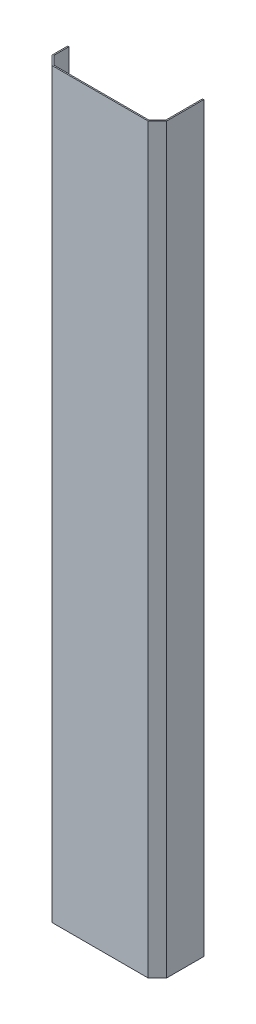
ISO-10303-21;
HEADER;
FILE_DESCRIPTION(('STEP AP214'),'2;1');
FILE_NAME('part.step','',(''),(''),'','','');
FILE_SCHEMA(('AUTOMOTIVE_DESIGN { 1 0 10303 214 1 1 1 1 }'));
ENDSEC;
DATA;
#1=APPLICATION_CONTEXT('core data for automotive mechanical design processes');
#2=APPLICATION_PROTOCOL_DEFINITION('international standard','automotive_design',2000,#1);
#3=PRODUCT_CONTEXT('',#1,'mechanical');
#4=PRODUCT('Part','Part','',(#3));
#5=PRODUCT_RELATED_PRODUCT_CATEGORY('part','',(#4));
#6=PRODUCT_DEFINITION_FORMATION('','',#4);
#7=PRODUCT_DEFINITION_CONTEXT('part definition',#1,'design');
#8=PRODUCT_DEFINITION('design','',#6,#7);
#9=PRODUCT_DEFINITION_SHAPE('','',#8);
#10=(LENGTH_UNIT() NAMED_UNIT(*) SI_UNIT(.MILLI.,.METRE.));
#11=(NAMED_UNIT(*) PLANE_ANGLE_UNIT() SI_UNIT($,.RADIAN.));
#12=(NAMED_UNIT(*) SI_UNIT($,.STERADIAN.) SOLID_ANGLE_UNIT());
#13=UNCERTAINTY_MEASURE_WITH_UNIT(LENGTH_MEASURE(1.E-05),#10,'distance_accuracy_value','');
#14=(GEOMETRIC_REPRESENTATION_CONTEXT(3) GLOBAL_UNCERTAINTY_ASSIGNED_CONTEXT((#13)) GLOBAL_UNIT_ASSIGNED_CONTEXT((#10,
#11,#12)) REPRESENTATION_CONTEXT('',''));
#15=CARTESIAN_POINT('',(0.,0.,0.));
#16=DIRECTION('',(0.,0.,1.));
#17=DIRECTION('',(1.,0.,0.));
#18=AXIS2_PLACEMENT_3D('',#15,#16,#17);
#19=CARTESIAN_POINT('',(0.,1200.,-40.));
#20=DIRECTION('',(0.,0.,-1.));
#21=DIRECTION('',(-1.,0.,0.));
#22=AXIS2_PLACEMENT_3D('',#19,#20,#21);
#23=PLANE('',#22);
#24=DIRECTION('',(-1.,0.,0.));
#25=VECTOR('',#24,1.);
#26=CARTESIAN_POINT('',(185.001,220.,-40.));
#27=LINE('',#26,#25);
#28=CARTESIAN_POINT('',(2.,220.,-40.));
#29=VERTEX_POINT('',#28);
#30=CARTESIAN_POINT('',(0.,220.,-40.));
#31=VERTEX_POINT('',#30);
#32=EDGE_CURVE('E173',#29,#31,#27,.T.);
#33=ORIENTED_EDGE('',*,*,#32,.T.);
#34=DIRECTION('',(0.,-1.,0.));
#35=VECTOR('',#34,1.);
#36=CARTESIAN_POINT('',(0.,1200.,-40.));
#37=LINE('',#36,#35);
#38=CARTESIAN_POINT('',(0.,1115.,-40.));
#39=VERTEX_POINT('',#38);
#40=EDGE_CURVE('E277',#39,#31,#37,.T.);
#41=ORIENTED_EDGE('',*,*,#40,.F.);
#42=DIRECTION('',(-1.,0.,0.));
#43=VECTOR('',#42,1.);
#44=CARTESIAN_POINT('',(185.001,1115.,-40.));
#45=LINE('',#44,#43);
#46=CARTESIAN_POINT('',(2.,1115.,-40.));
#47=VERTEX_POINT('',#46);
#48=EDGE_CURVE('E58',#47,#39,#45,.T.);
#49=ORIENTED_EDGE('',*,*,#48,.F.);
#50=DIRECTION('',(0.,-1.,0.));
#51=VECTOR('',#50,1.);
#52=CARTESIAN_POINT('',(2.,1200.,-40.));
#53=LINE('',#52,#51);
#54=EDGE_CURVE('E190',#47,#29,#53,.T.);
#55=ORIENTED_EDGE('',*,*,#54,.T.);
#56=EDGE_LOOP('',(#33,#41,#49,#55));
#57=FACE_BOUND('',#56,.T.);
#58=ADVANCED_FACE('F35',(#57),#23,.T.);
#59=DIRECTION('',(-1.,0.,0.));
#60=VECTOR('',#59,1.);
#61=CARTESIAN_POINT('',(185.001,1155.,-40.));
#62=LINE('',#61,#60);
#63=CARTESIAN_POINT('',(2.,1155.,-40.));
#64=VERTEX_POINT('',#63);
#65=CARTESIAN_POINT('',(0.,1155.,-40.));
#66=VERTEX_POINT('',#65);
#67=EDGE_CURVE('E295',#64,#66,#62,.T.);
#68=ORIENTED_EDGE('',*,*,#67,.T.);
#69=CARTESIAN_POINT('',(0.,1200.,-40.));
#70=VERTEX_POINT('',#69);
#71=EDGE_CURVE('E200',#70,#66,#37,.T.);
#72=ORIENTED_EDGE('',*,*,#71,.F.);
#73=DIRECTION('',(1.,0.,0.));
#74=VECTOR('',#73,1.);
#75=CARTESIAN_POINT('',(0.,1200.,-40.));
#76=LINE('',#75,#74);
#77=CARTESIAN_POINT('',(2.,1200.,-40.));
#78=VERTEX_POINT('',#77);
#79=EDGE_CURVE('E294',#70,#78,#76,.T.);
#80=ORIENTED_EDGE('',*,*,#79,.T.);
#81=EDGE_CURVE('E195',#78,#64,#53,.T.);
#82=ORIENTED_EDGE('',*,*,#81,.T.);
#83=EDGE_LOOP('',(#68,#72,#80,#82));
#84=FACE_BOUND('',#83,.T.);
#85=ADVANCED_FACE('F293',(#84),#23,.T.);
#86=CARTESIAN_POINT('',(83.5857864376268,1200.,83.5857864376269));
#87=DIRECTION('',(-0.707106781186547,0.,-0.707106781186548));
#88=DIRECTION('',(-0.707106781186548,0.,0.707106781186547));
#89=AXIS2_PLACEMENT_3D('',#86,#87,#88);
#90=PLANE('',#89);
#91=DIRECTION('',(0.707106781186548,0.,-0.707106781186547));
#92=VECTOR('',#91,1.);
#93=CARTESIAN_POINT('',(83.5857864376268,0.,83.5857864376269));
#94=LINE('',#93,#92);
#95=CARTESIAN_POINT('',(169.171572875254,0.,-2.));
#96=VERTEX_POINT('',#95);
#97=CARTESIAN_POINT('',(183.,0.,-15.8284271247462));
#98=VERTEX_POINT('',#97);
#99=EDGE_CURVE('E228',#96,#98,#94,.T.);
#100=ORIENTED_EDGE('',*,*,#99,.F.);
#101=DIRECTION('',(0.,-1.,0.));
#102=VECTOR('',#101,1.);
#103=CARTESIAN_POINT('',(169.171572875254,1200.,-2.));
#104=LINE('',#103,#102);
#105=CARTESIAN_POINT('',(169.171572875254,1200.,-2.));
#106=VERTEX_POINT('',#105);
#107=EDGE_CURVE('E11',#106,#96,#104,.T.);
#108=ORIENTED_EDGE('',*,*,#107,.F.);
#109=DIRECTION('',(0.707106781186548,0.,-0.707106781186547));
#110=VECTOR('',#109,1.);
#111=CARTESIAN_POINT('',(83.5857864376268,1200.,83.5857864376269));
#112=LINE('',#111,#110);
#113=CARTESIAN_POINT('',(183.,1200.,-15.8284271247462));
#114=VERTEX_POINT('',#113);
#115=EDGE_CURVE('E255',#106,#114,#112,.T.);
#116=ORIENTED_EDGE('',*,*,#115,.T.);
#117=DIRECTION('',(0.,-1.,0.));
#118=VECTOR('',#117,1.);
#119=CARTESIAN_POINT('',(183.,1200.,-15.8284271247462));
#120=LINE('',#119,#118);
#121=EDGE_CURVE('E256',#114,#98,#120,.T.);
#122=ORIENTED_EDGE('',*,*,#121,.T.);
#123=EDGE_LOOP('',(#100,#108,#116,#122));
#124=FACE_BOUND('',#123,.T.);
#125=ADVANCED_FACE('F37',(#124),#90,.T.);
#126=CARTESIAN_POINT('',(0.,1200.,-2.));
#127=DIRECTION('',(0.,0.,-1.));
#128=DIRECTION('',(-1.,0.,0.));
#129=AXIS2_PLACEMENT_3D('',#126,#127,#128);
#130=PLANE('',#129);
#131=DIRECTION('',(1.,0.,0.));
#132=VECTOR('',#131,1.);
#133=CARTESIAN_POINT('',(0.,0.,-2.));
#134=LINE('',#133,#132);
#135=CARTESIAN_POINT('',(15.8284271247462,0.,-2.));
#136=VERTEX_POINT('',#135);
#137=EDGE_CURVE('E221',#136,#96,#134,.T.);
#138=ORIENTED_EDGE('',*,*,#137,.F.);
#139=DIRECTION('',(0.,-1.,0.));
#140=VECTOR('',#139,1.);
#141=CARTESIAN_POINT('',(15.8284271247462,1200.,-2.));
#142=LINE('',#141,#140);
#143=CARTESIAN_POINT('',(15.8284271247462,1200.,-2.));
#144=VERTEX_POINT('',#143);
#145=EDGE_CURVE('E43',#144,#136,#142,.T.);
#146=ORIENTED_EDGE('',*,*,#145,.F.);
#147=DIRECTION('',(1.,0.,0.));
#148=VECTOR('',#147,1.);
#149=CARTESIAN_POINT('',(0.,1200.,-2.));
#150=LINE('',#149,#148);
#151=EDGE_CURVE('E332',#144,#106,#150,.T.);
#152=ORIENTED_EDGE('',*,*,#151,.T.);
#153=ORIENTED_EDGE('',*,*,#107,.T.);
#154=EDGE_LOOP('',(#138,#146,#152,#153));
#155=FACE_BOUND('',#154,.T.);
#156=ADVANCED_FACE('F226',(#155),#130,.T.);
#157=CARTESIAN_POINT('',(8.9142135623731,1200.,-8.9142135623731));
#158=DIRECTION('',(-0.707106781186548,0.,0.707106781186548));
#159=DIRECTION('',(0.707106781186548,0.,0.707106781186548));
#160=AXIS2_PLACEMENT_3D('',#157,#158,#159);
#161=PLANE('',#160);
#162=DIRECTION('',(-0.707106781186548,0.,-0.707106781186548));
#163=VECTOR('',#162,1.);
#164=CARTESIAN_POINT('',(8.9142135623731,0.,-8.9142135623731));
#165=LINE('',#164,#163);
#166=CARTESIAN_POINT('',(2.,0.,-15.8284271247462));
#167=VERTEX_POINT('',#166);
#168=EDGE_CURVE('E210',#136,#167,#165,.T.);
#169=ORIENTED_EDGE('',*,*,#168,.T.);
#170=DIRECTION('',(0.,-1.,0.));
#171=VECTOR('',#170,1.);
#172=CARTESIAN_POINT('',(2.,1200.,-15.8284271247462));
#173=LINE('',#172,#171);
#174=CARTESIAN_POINT('',(2.,1200.,-15.8284271247462));
#175=VERTEX_POINT('',#174);
#176=EDGE_CURVE('E199',#175,#167,#173,.T.);
#177=ORIENTED_EDGE('',*,*,#176,.F.);
#178=DIRECTION('',(-0.707106781186548,0.,-0.707106781186548));
#179=VECTOR('',#178,1.);
#180=CARTESIAN_POINT('',(8.9142135623731,1200.,-8.9142135623731));
#181=LINE('',#180,#179);
#182=EDGE_CURVE('E211',#144,#175,#181,.T.);
#183=ORIENTED_EDGE('',*,*,#182,.F.);
#184=ORIENTED_EDGE('',*,*,#145,.T.);
#185=EDGE_LOOP('',(#169,#177,#183,#184));
#186=FACE_BOUND('',#185,.T.);
#187=ADVANCED_FACE('F208',(#186),#161,.F.);
#188=CARTESIAN_POINT('',(2.,1200.,0.));
#189=DIRECTION('',(-1.,0.,0.));
#190=DIRECTION('',(0.,0.,1.));
#191=AXIS2_PLACEMENT_3D('',#188,#189,#190);
#192=PLANE('',#191);
#193=DIRECTION('',(0.,-1.,0.));
#194=VECTOR('',#193,1.);
#195=CARTESIAN_POINT('',(2.,220.,-20.));
#196=LINE('',#195,#194);
#197=CARTESIAN_POINT('',(2.,220.,-20.));
#198=VERTEX_POINT('',#197);
#199=CARTESIAN_POINT('',(2.,180.,-20.));
#200=VERTEX_POINT('',#199);
#201=EDGE_CURVE('E193',#198,#200,#196,.T.);
#202=ORIENTED_EDGE('',*,*,#201,.F.);
#203=DIRECTION('',(0.,0.,1.));
#204=VECTOR('',#203,1.);
#205=CARTESIAN_POINT('',(2.,220.,-40.));
#206=LINE('',#205,#204);
#207=EDGE_CURVE('E176',#29,#198,#206,.T.);
#208=ORIENTED_EDGE('',*,*,#207,.F.);
#209=ORIENTED_EDGE('',*,*,#54,.F.);
#210=DIRECTION('',(0.,0.,-1.));
#211=VECTOR('',#210,1.);
#212=CARTESIAN_POINT('',(2.,1115.,-40.));
#213=LINE('',#212,#211);
#214=CARTESIAN_POINT('',(2.,1115.,-20.));
#215=VERTEX_POINT('',#214);
#216=EDGE_CURVE('E345',#215,#47,#213,.T.);
#217=ORIENTED_EDGE('',*,*,#216,.F.);
#218=DIRECTION('',(0.,-1.,0.));
#219=VECTOR('',#218,1.);
#220=CARTESIAN_POINT('',(2.,1155.,-20.));
#221=LINE('',#220,#219);
#222=CARTESIAN_POINT('',(2.,1155.,-20.));
#223=VERTEX_POINT('',#222);
#224=EDGE_CURVE('E342',#223,#215,#221,.T.);
#225=ORIENTED_EDGE('',*,*,#224,.F.);
#226=DIRECTION('',(0.,0.,1.));
#227=VECTOR('',#226,1.);
#228=CARTESIAN_POINT('',(2.,1155.,-40.));
#229=LINE('',#228,#227);
#230=EDGE_CURVE('E340',#64,#223,#229,.T.);
#231=ORIENTED_EDGE('',*,*,#230,.F.);
#232=ORIENTED_EDGE('',*,*,#81,.F.);
#233=DIRECTION('',(0.,0.,-1.));
#234=VECTOR('',#233,1.);
#235=CARTESIAN_POINT('',(2.,1200.,0.));
#236=LINE('',#235,#234);
#237=EDGE_CURVE('E301',#175,#78,#236,.T.);
#238=ORIENTED_EDGE('',*,*,#237,.F.);
#239=ORIENTED_EDGE('',*,*,#176,.T.);
#240=DIRECTION('',(0.,0.,-1.));
#241=VECTOR('',#240,1.);
#242=CARTESIAN_POINT('',(2.,0.,0.));
#243=LINE('',#242,#241);
#244=CARTESIAN_POINT('',(2.,0.,-40.));
#245=VERTEX_POINT('',#244);
#246=EDGE_CURVE('E224',#167,#245,#243,.T.);
#247=ORIENTED_EDGE('',*,*,#246,.T.);
#248=CARTESIAN_POINT('',(2.,180.,-40.));
#249=VERTEX_POINT('',#248);
#250=EDGE_CURVE('E196',#249,#245,#53,.T.);
#251=ORIENTED_EDGE('',*,*,#250,.F.);
#252=DIRECTION('',(0.,0.,-1.));
#253=VECTOR('',#252,1.);
#254=CARTESIAN_POINT('',(2.,180.,-40.));
#255=LINE('',#254,#253);
#256=EDGE_CURVE('E230',#200,#249,#255,.T.);
#257=ORIENTED_EDGE('',*,*,#256,.F.);
#258=EDGE_LOOP('',(#202,#208,#209,#217,#225,#231,#232,#238,#239,#247,#251,#257));
#259=FACE_BOUND('',#258,.T.);
#260=ADVANCED_FACE('F188',(#259),#192,.F.);
#261=DIRECTION('',(-1.,0.,0.));
#262=VECTOR('',#261,1.);
#263=CARTESIAN_POINT('',(185.001,180.,-40.));
#264=LINE('',#263,#262);
#265=CARTESIAN_POINT('',(0.,180.,-40.));
#266=VERTEX_POINT('',#265);
#267=EDGE_CURVE('E50',#249,#266,#264,.T.);
#268=ORIENTED_EDGE('',*,*,#267,.F.);
#269=ORIENTED_EDGE('',*,*,#250,.T.);
#270=DIRECTION('',(1.,0.,0.));
#271=VECTOR('',#270,1.);
#272=CARTESIAN_POINT('',(0.,0.,-40.));
#273=LINE('',#272,#271);
#274=CARTESIAN_POINT('',(0.,0.,-40.));
#275=VERTEX_POINT('',#274);
#276=EDGE_CURVE('E235',#275,#245,#273,.T.);
#277=ORIENTED_EDGE('',*,*,#276,.F.);
#278=EDGE_CURVE('E272',#266,#275,#37,.T.);
#279=ORIENTED_EDGE('',*,*,#278,.F.);
#280=EDGE_LOOP('',(#268,#269,#277,#279));
#281=FACE_BOUND('',#280,.T.);
#282=ADVANCED_FACE('F374',(#281),#23,.T.);
#283=CARTESIAN_POINT('',(0.,1200.,0.));
#284=DIRECTION('',(-1.,0.,0.));
#285=DIRECTION('',(0.,0.,1.));
#286=AXIS2_PLACEMENT_3D('',#283,#284,#285);
#287=PLANE('',#286);
#288=DIRECTION('',(0.,0.,-1.));
#289=VECTOR('',#288,1.);
#290=CARTESIAN_POINT('',(0.,220.,-40.));
#291=LINE('',#290,#289);
#292=CARTESIAN_POINT('',(0.,220.,-20.));
#293=VERTEX_POINT('',#292);
#294=EDGE_CURVE('E179',#293,#31,#291,.T.);
#295=ORIENTED_EDGE('',*,*,#294,.F.);
#296=DIRECTION('',(0.,1.,0.));
#297=VECTOR('',#296,1.);
#298=CARTESIAN_POINT('',(0.,220.,-20.));
#299=LINE('',#298,#297);
#300=CARTESIAN_POINT('',(0.,180.,-20.));
#301=VERTEX_POINT('',#300);
#302=EDGE_CURVE('E367',#301,#293,#299,.T.);
#303=ORIENTED_EDGE('',*,*,#302,.F.);
#304=DIRECTION('',(0.,0.,1.));
#305=VECTOR('',#304,1.);
#306=CARTESIAN_POINT('',(0.,180.,-40.));
#307=LINE('',#306,#305);
#308=EDGE_CURVE('E363',#266,#301,#307,.T.);
#309=ORIENTED_EDGE('',*,*,#308,.F.);
#310=ORIENTED_EDGE('',*,*,#278,.T.);
#311=DIRECTION('',(0.,0.,-1.));
#312=VECTOR('',#311,1.);
#313=CARTESIAN_POINT('',(0.,0.,0.));
#314=LINE('',#313,#312);
#315=CARTESIAN_POINT('',(0.,0.,-15.));
#316=VERTEX_POINT('',#315);
#317=EDGE_CURVE('E237',#316,#275,#314,.T.);
#318=ORIENTED_EDGE('',*,*,#317,.F.);
#319=DIRECTION('',(0.,-1.,0.));
#320=VECTOR('',#319,1.);
#321=CARTESIAN_POINT('',(0.,1200.,-15.));
#322=LINE('',#321,#320);
#323=CARTESIAN_POINT('',(0.,1200.,-15.));
#324=VERTEX_POINT('',#323);
#325=EDGE_CURVE('E271',#324,#316,#322,.T.);
#326=ORIENTED_EDGE('',*,*,#325,.F.);
#327=DIRECTION('',(0.,0.,-1.));
#328=VECTOR('',#327,1.);
#329=CARTESIAN_POINT('',(0.,1200.,0.));
#330=LINE('',#329,#328);
#331=EDGE_CURVE('E288',#324,#70,#330,.T.);
#332=ORIENTED_EDGE('',*,*,#331,.T.);
#333=ORIENTED_EDGE('',*,*,#71,.T.);
#334=DIRECTION('',(0.,0.,-1.));
#335=VECTOR('',#334,1.);
#336=CARTESIAN_POINT('',(0.,1155.,-40.));
#337=LINE('',#336,#335);
#338=CARTESIAN_POINT('',(0.,1155.,-20.));
#339=VERTEX_POINT('',#338);
#340=EDGE_CURVE('E286',#339,#66,#337,.T.);
#341=ORIENTED_EDGE('',*,*,#340,.F.);
#342=DIRECTION('',(0.,1.,0.));
#343=VECTOR('',#342,1.);
#344=CARTESIAN_POINT('',(0.,1155.,-20.));
#345=LINE('',#344,#343);
#346=CARTESIAN_POINT('',(0.,1115.,-20.));
#347=VERTEX_POINT('',#346);
#348=EDGE_CURVE('E347',#347,#339,#345,.T.);
#349=ORIENTED_EDGE('',*,*,#348,.F.);
#350=DIRECTION('',(0.,0.,1.));
#351=VECTOR('',#350,1.);
#352=CARTESIAN_POINT('',(0.,1115.,-40.));
#353=LINE('',#352,#351);
#354=EDGE_CURVE('E350',#39,#347,#353,.T.);
#355=ORIENTED_EDGE('',*,*,#354,.F.);
#356=ORIENTED_EDGE('',*,*,#40,.T.);
#357=EDGE_LOOP('',(#295,#303,#309,#310,#318,#326,#332,#333,#341,#349,#355,#356));
#358=FACE_BOUND('',#357,.T.);
#359=ADVANCED_FACE('F284',(#358),#287,.T.);
#360=CARTESIAN_POINT('',(7.5,1200.,-7.5));
#361=DIRECTION('',(-0.707106781186548,0.,0.707106781186548));
#362=DIRECTION('',(0.707106781186548,0.,0.707106781186548));
#363=AXIS2_PLACEMENT_3D('',#360,#361,#362);
#364=PLANE('',#363);
#365=DIRECTION('',(-0.707106781186548,0.,-0.707106781186548));
#366=VECTOR('',#365,1.);
#367=CARTESIAN_POINT('',(7.5,0.,-7.5));
#368=LINE('',#367,#366);
#369=CARTESIAN_POINT('',(15.,0.,0.));
#370=VERTEX_POINT('',#369);
#371=EDGE_CURVE('E240',#370,#316,#368,.T.);
#372=ORIENTED_EDGE('',*,*,#371,.F.);
#373=DIRECTION('',(0.,-1.,0.));
#374=VECTOR('',#373,1.);
#375=CARTESIAN_POINT('',(15.,1200.,0.));
#376=LINE('',#375,#374);
#377=CARTESIAN_POINT('',(15.,1200.,0.));
#378=VERTEX_POINT('',#377);
#379=EDGE_CURVE('E270',#378,#370,#376,.T.);
#380=ORIENTED_EDGE('',*,*,#379,.F.);
#381=DIRECTION('',(-0.707106781186548,0.,-0.707106781186548));
#382=VECTOR('',#381,1.);
#383=CARTESIAN_POINT('',(7.5,1200.,-7.5));
#384=LINE('',#383,#382);
#385=EDGE_CURVE('E304',#378,#324,#384,.T.);
#386=ORIENTED_EDGE('',*,*,#385,.T.);
#387=ORIENTED_EDGE('',*,*,#325,.T.);
#388=EDGE_LOOP('',(#372,#380,#386,#387));
#389=FACE_BOUND('',#388,.T.);
#390=ADVANCED_FACE('F377',(#389),#364,.T.);
#391=CARTESIAN_POINT('',(0.,1200.,0.));
#392=DIRECTION('',(0.,0.,-1.));
#393=DIRECTION('',(-1.,0.,0.));
#394=AXIS2_PLACEMENT_3D('',#391,#392,#393);
#395=PLANE('',#394);
#396=DIRECTION('',(1.,0.,0.));
#397=VECTOR('',#396,1.);
#398=CARTESIAN_POINT('',(0.,0.,0.));
#399=LINE('',#398,#397);
#400=CARTESIAN_POINT('',(170.,0.,0.));
#401=VERTEX_POINT('',#400);
#402=EDGE_CURVE('E243',#370,#401,#399,.T.);
#403=ORIENTED_EDGE('',*,*,#402,.T.);
#404=DIRECTION('',(0.,-1.,0.));
#405=VECTOR('',#404,1.);
#406=CARTESIAN_POINT('',(170.,1200.,0.));
#407=LINE('',#406,#405);
#408=CARTESIAN_POINT('',(170.,1200.,0.));
#409=VERTEX_POINT('',#408);
#410=EDGE_CURVE('E267',#409,#401,#407,.T.);
#411=ORIENTED_EDGE('',*,*,#410,.F.);
#412=DIRECTION('',(1.,0.,0.));
#413=VECTOR('',#412,1.);
#414=CARTESIAN_POINT('',(0.,1200.,0.));
#415=LINE('',#414,#413);
#416=EDGE_CURVE('E310',#378,#409,#415,.T.);
#417=ORIENTED_EDGE('',*,*,#416,.F.);
#418=ORIENTED_EDGE('',*,*,#379,.T.);
#419=EDGE_LOOP('',(#403,#411,#417,#418));
#420=FACE_BOUND('',#419,.T.);
#421=ADVANCED_FACE('F381',(#420),#395,.F.);
#422=CARTESIAN_POINT('',(84.9999999999999,1200.,85.));
#423=DIRECTION('',(-0.707106781186547,0.,-0.707106781186548));
#424=DIRECTION('',(-0.707106781186548,0.,0.707106781186547));
#425=AXIS2_PLACEMENT_3D('',#422,#423,#424);
#426=PLANE('',#425);
#427=DIRECTION('',(0.707106781186548,0.,-0.707106781186547));
#428=VECTOR('',#427,1.);
#429=CARTESIAN_POINT('',(84.9999999999999,0.,85.));
#430=LINE('',#429,#428);
#431=CARTESIAN_POINT('',(185.,0.,-15.));
#432=VERTEX_POINT('',#431);
#433=EDGE_CURVE('E245',#401,#432,#430,.T.);
#434=ORIENTED_EDGE('',*,*,#433,.T.);
#435=DIRECTION('',(0.,-1.,0.));
#436=VECTOR('',#435,1.);
#437=CARTESIAN_POINT('',(185.,1200.,-15.));
#438=LINE('',#437,#436);
#439=CARTESIAN_POINT('',(185.,1200.,-15.));
#440=VERTEX_POINT('',#439);
#441=EDGE_CURVE('E264',#440,#432,#438,.T.);
#442=ORIENTED_EDGE('',*,*,#441,.F.);
#443=DIRECTION('',(0.707106781186548,0.,-0.707106781186547));
#444=VECTOR('',#443,1.);
#445=CARTESIAN_POINT('',(84.9999999999999,1200.,85.));
#446=LINE('',#445,#444);
#447=EDGE_CURVE('E312',#409,#440,#446,.T.);
#448=ORIENTED_EDGE('',*,*,#447,.F.);
#449=ORIENTED_EDGE('',*,*,#410,.T.);
#450=EDGE_LOOP('',(#434,#442,#448,#449));
#451=FACE_BOUND('',#450,.T.);
#452=ADVANCED_FACE('F385',(#451),#426,.F.);
#453=CARTESIAN_POINT('',(185.,1200.,0.));
#454=DIRECTION('',(-1.,0.,0.));
#455=DIRECTION('',(0.,0.,1.));
#456=AXIS2_PLACEMENT_3D('',#453,#454,#455);
#457=PLANE('',#456);
#458=DIRECTION('',(0.,0.,-1.));
#459=VECTOR('',#458,1.);
#460=CARTESIAN_POINT('',(185.,0.,0.));
#461=LINE('',#460,#459);
#462=CARTESIAN_POINT('',(185.,0.,-75.));
#463=VERTEX_POINT('',#462);
#464=EDGE_CURVE('E247',#432,#463,#461,.T.);
#465=ORIENTED_EDGE('',*,*,#464,.T.);
#466=DIRECTION('',(0.,-1.,0.));
#467=VECTOR('',#466,1.);
#468=CARTESIAN_POINT('',(185.,1200.,-75.));
#469=LINE('',#468,#467);
#470=CARTESIAN_POINT('',(185.,1200.,-75.));
#471=VERTEX_POINT('',#470);
#472=EDGE_CURVE('E261',#471,#463,#469,.T.);
#473=ORIENTED_EDGE('',*,*,#472,.F.);
#474=DIRECTION('',(0.,0.,-1.));
#475=VECTOR('',#474,1.);
#476=CARTESIAN_POINT('',(185.,1200.,0.));
#477=LINE('',#476,#475);
#478=EDGE_CURVE('E314',#440,#471,#477,.T.);
#479=ORIENTED_EDGE('',*,*,#478,.F.);
#480=ORIENTED_EDGE('',*,*,#441,.T.);
#481=EDGE_LOOP('',(#465,#473,#479,#480));
#482=FACE_BOUND('',#481,.T.);
#483=ADVANCED_FACE('F387',(#482),#457,.F.);
#484=CARTESIAN_POINT('',(0.,1200.,-75.));
#485=DIRECTION('',(0.,0.,1.));
#486=DIRECTION('',(1.,0.,0.));
#487=AXIS2_PLACEMENT_3D('',#484,#485,#486);
#488=PLANE('',#487);
#489=DIRECTION('',(-1.,0.,0.));
#490=VECTOR('',#489,1.);
#491=CARTESIAN_POINT('',(0.,0.,-75.));
#492=LINE('',#491,#490);
#493=CARTESIAN_POINT('',(183.,0.,-75.));
#494=VERTEX_POINT('',#493);
#495=EDGE_CURVE('E249',#463,#494,#492,.T.);
#496=ORIENTED_EDGE('',*,*,#495,.T.);
#497=DIRECTION('',(0.,-1.,0.));
#498=VECTOR('',#497,1.);
#499=CARTESIAN_POINT('',(183.,1200.,-75.));
#500=LINE('',#499,#498);
#501=CARTESIAN_POINT('',(183.,1200.,-75.));
#502=VERTEX_POINT('',#501);
#503=EDGE_CURVE('E258',#502,#494,#500,.T.);
#504=ORIENTED_EDGE('',*,*,#503,.F.);
#505=DIRECTION('',(-1.,0.,0.));
#506=VECTOR('',#505,1.);
#507=CARTESIAN_POINT('',(0.,1200.,-75.));
#508=LINE('',#507,#506);
#509=EDGE_CURVE('E316',#471,#502,#508,.T.);
#510=ORIENTED_EDGE('',*,*,#509,.F.);
#511=ORIENTED_EDGE('',*,*,#472,.T.);
#512=EDGE_LOOP('',(#496,#504,#510,#511));
#513=FACE_BOUND('',#512,.T.);
#514=ADVANCED_FACE('F328',(#513),#488,.F.);
#515=CARTESIAN_POINT('',(183.,1200.,0.));
#516=DIRECTION('',(-1.,0.,0.));
#517=DIRECTION('',(0.,0.,1.));
#518=AXIS2_PLACEMENT_3D('',#515,#516,#517);
#519=PLANE('',#518);
#520=DIRECTION('',(0.,0.,-1.));
#521=VECTOR('',#520,1.);
#522=CARTESIAN_POINT('',(183.,0.,0.));
#523=LINE('',#522,#521);
#524=EDGE_CURVE('E252',#98,#494,#523,.T.);
#525=ORIENTED_EDGE('',*,*,#524,.F.);
#526=ORIENTED_EDGE('',*,*,#121,.F.);
#527=DIRECTION('',(0.,0.,-1.));
#528=VECTOR('',#527,1.);
#529=CARTESIAN_POINT('',(183.,1200.,0.));
#530=LINE('',#529,#528);
#531=EDGE_CURVE('E259',#114,#502,#530,.T.);
#532=ORIENTED_EDGE('',*,*,#531,.T.);
#533=ORIENTED_EDGE('',*,*,#503,.T.);
#534=EDGE_LOOP('',(#525,#526,#532,#533));
#535=FACE_BOUND('',#534,.T.);
#536=ADVANCED_FACE('F321',(#535),#519,.T.);
#537=CARTESIAN_POINT('',(0.,1200.,0.));
#538=DIRECTION('',(0.,1.,0.));
#539=DIRECTION('',(0.,0.,1.));
#540=AXIS2_PLACEMENT_3D('',#537,#538,#539);
#541=PLANE('',#540);
#542=ORIENTED_EDGE('',*,*,#115,.F.);
#543=ORIENTED_EDGE('',*,*,#151,.F.);
#544=ORIENTED_EDGE('',*,*,#182,.T.);
#545=ORIENTED_EDGE('',*,*,#237,.T.);
#546=ORIENTED_EDGE('',*,*,#79,.F.);
#547=ORIENTED_EDGE('',*,*,#331,.F.);
#548=ORIENTED_EDGE('',*,*,#385,.F.);
#549=ORIENTED_EDGE('',*,*,#416,.T.);
#550=ORIENTED_EDGE('',*,*,#447,.T.);
#551=ORIENTED_EDGE('',*,*,#478,.T.);
#552=ORIENTED_EDGE('',*,*,#509,.T.);
#553=ORIENTED_EDGE('',*,*,#531,.F.);
#554=EDGE_LOOP('',(#542,#543,#544,#545,#546,#547,#548,#549,#550,#551,#552,#553));
#555=FACE_BOUND('',#554,.T.);
#556=ADVANCED_FACE('F298',(#555),#541,.T.);
#557=CARTESIAN_POINT('',(0.,0.,0.));
#558=DIRECTION('',(0.,1.,0.));
#559=DIRECTION('',(0.,0.,1.));
#560=AXIS2_PLACEMENT_3D('',#557,#558,#559);
#561=PLANE('',#560);
#562=ORIENTED_EDGE('',*,*,#99,.T.);
#563=ORIENTED_EDGE('',*,*,#524,.T.);
#564=ORIENTED_EDGE('',*,*,#495,.F.);
#565=ORIENTED_EDGE('',*,*,#464,.F.);
#566=ORIENTED_EDGE('',*,*,#433,.F.);
#567=ORIENTED_EDGE('',*,*,#402,.F.);
#568=ORIENTED_EDGE('',*,*,#371,.T.);
#569=ORIENTED_EDGE('',*,*,#317,.T.);
#570=ORIENTED_EDGE('',*,*,#276,.T.);
#571=ORIENTED_EDGE('',*,*,#246,.F.);
#572=ORIENTED_EDGE('',*,*,#168,.F.);
#573=ORIENTED_EDGE('',*,*,#137,.T.);
#574=EDGE_LOOP('',(#562,#563,#564,#565,#566,#567,#568,#569,#570,#571,#572,#573));
#575=FACE_BOUND('',#574,.T.);
#576=ADVANCED_FACE('F220',(#575),#561,.F.);
#577=CARTESIAN_POINT('',(185.001,1155.,-40.));
#578=DIRECTION('',(0.,1.,0.));
#579=DIRECTION('',(0.,0.,1.));
#580=AXIS2_PLACEMENT_3D('',#577,#578,#579);
#581=PLANE('',#580);
#582=ORIENTED_EDGE('',*,*,#230,.T.);
#583=DIRECTION('',(-1.,0.,0.));
#584=VECTOR('',#583,1.);
#585=CARTESIAN_POINT('',(185.001,1155.,-20.));
#586=LINE('',#585,#584);
#587=EDGE_CURVE('E354',#223,#339,#586,.T.);
#588=ORIENTED_EDGE('',*,*,#587,.T.);
#589=ORIENTED_EDGE('',*,*,#340,.T.);
#590=ORIENTED_EDGE('',*,*,#67,.F.);
#591=EDGE_LOOP('',(#582,#588,#589,#590));
#592=FACE_BOUND('',#591,.T.);
#593=ADVANCED_FACE('F448',(#592),#581,.F.);
#594=CARTESIAN_POINT('',(185.001,1155.,-20.));
#595=DIRECTION('',(0.,0.,1.));
#596=DIRECTION('',(0.,-1.,0.));
#597=AXIS2_PLACEMENT_3D('',#594,#595,#596);
#598=PLANE('',#597);
#599=ORIENTED_EDGE('',*,*,#224,.T.);
#600=DIRECTION('',(-1.,0.,0.));
#601=VECTOR('',#600,1.);
#602=CARTESIAN_POINT('',(185.001,1115.,-20.));
#603=LINE('',#602,#601);
#604=EDGE_CURVE('E355',#215,#347,#603,.T.);
#605=ORIENTED_EDGE('',*,*,#604,.T.);
#606=ORIENTED_EDGE('',*,*,#348,.T.);
#607=ORIENTED_EDGE('',*,*,#587,.F.);
#608=EDGE_LOOP('',(#599,#605,#606,#607));
#609=FACE_BOUND('',#608,.T.);
#610=ADVANCED_FACE('F453',(#609),#598,.F.);
#611=CARTESIAN_POINT('',(185.001,1115.,-40.));
#612=DIRECTION('',(0.,-1.,0.));
#613=DIRECTION('',(0.,0.,-1.));
#614=AXIS2_PLACEMENT_3D('',#611,#612,#613);
#615=PLANE('',#614);
#616=ORIENTED_EDGE('',*,*,#216,.T.);
#617=ORIENTED_EDGE('',*,*,#48,.T.);
#618=ORIENTED_EDGE('',*,*,#354,.T.);
#619=ORIENTED_EDGE('',*,*,#604,.F.);
#620=EDGE_LOOP('',(#616,#617,#618,#619));
#621=FACE_BOUND('',#620,.T.);
#622=ADVANCED_FACE('F463',(#621),#615,.F.);
#623=CARTESIAN_POINT('',(185.001,220.,-40.));
#624=DIRECTION('',(0.,1.,0.));
#625=DIRECTION('',(0.,0.,1.));
#626=AXIS2_PLACEMENT_3D('',#623,#624,#625);
#627=PLANE('',#626);
#628=ORIENTED_EDGE('',*,*,#207,.T.);
#629=DIRECTION('',(-1.,0.,0.));
#630=VECTOR('',#629,1.);
#631=CARTESIAN_POINT('',(185.001,220.,-20.));
#632=LINE('',#631,#630);
#633=EDGE_CURVE('E184',#198,#293,#632,.T.);
#634=ORIENTED_EDGE('',*,*,#633,.T.);
#635=ORIENTED_EDGE('',*,*,#294,.T.);
#636=ORIENTED_EDGE('',*,*,#32,.F.);
#637=EDGE_LOOP('',(#628,#634,#635,#636));
#638=FACE_BOUND('',#637,.T.);
#639=ADVANCED_FACE('F175',(#638),#627,.F.);
#640=CARTESIAN_POINT('',(185.001,220.,-20.));
#641=DIRECTION('',(0.,0.,1.));
#642=DIRECTION('',(0.,-1.,0.));
#643=AXIS2_PLACEMENT_3D('',#640,#641,#642);
#644=PLANE('',#643);
#645=ORIENTED_EDGE('',*,*,#201,.T.);
#646=DIRECTION('',(-1.,0.,0.));
#647=VECTOR('',#646,1.);
#648=CARTESIAN_POINT('',(185.001,180.,-20.));
#649=LINE('',#648,#647);
#650=EDGE_CURVE('E361',#200,#301,#649,.T.);
#651=ORIENTED_EDGE('',*,*,#650,.T.);
#652=ORIENTED_EDGE('',*,*,#302,.T.);
#653=ORIENTED_EDGE('',*,*,#633,.F.);
#654=EDGE_LOOP('',(#645,#651,#652,#653));
#655=FACE_BOUND('',#654,.T.);
#656=ADVANCED_FACE('F480',(#655),#644,.F.);
#657=CARTESIAN_POINT('',(185.001,180.,-40.));
#658=DIRECTION('',(0.,-1.,0.));
#659=DIRECTION('',(0.,0.,-1.));
#660=AXIS2_PLACEMENT_3D('',#657,#658,#659);
#661=PLANE('',#660);
#662=ORIENTED_EDGE('',*,*,#256,.T.);
#663=ORIENTED_EDGE('',*,*,#267,.T.);
#664=ORIENTED_EDGE('',*,*,#308,.T.);
#665=ORIENTED_EDGE('',*,*,#650,.F.);
#666=EDGE_LOOP('',(#662,#663,#664,#665));
#667=FACE_BOUND('',#666,.T.);
#668=ADVANCED_FACE('F371',(#667),#661,.F.);
#669=CLOSED_SHELL('',(#58,#85,#125,#156,#187,#260,#282,#359,#390,#421,#452,#483,#514,#536,#556,
#576,#593,#610,#622,#639,#656,#668));
#670=MANIFOLD_SOLID_BREP('B2',#669);
#671=ADVANCED_BREP_SHAPE_REPRESENTATION('',(#18,#670),#14);
#672=SHAPE_DEFINITION_REPRESENTATION(#9,#671);
ENDSEC;
END-ISO-10303-21;
